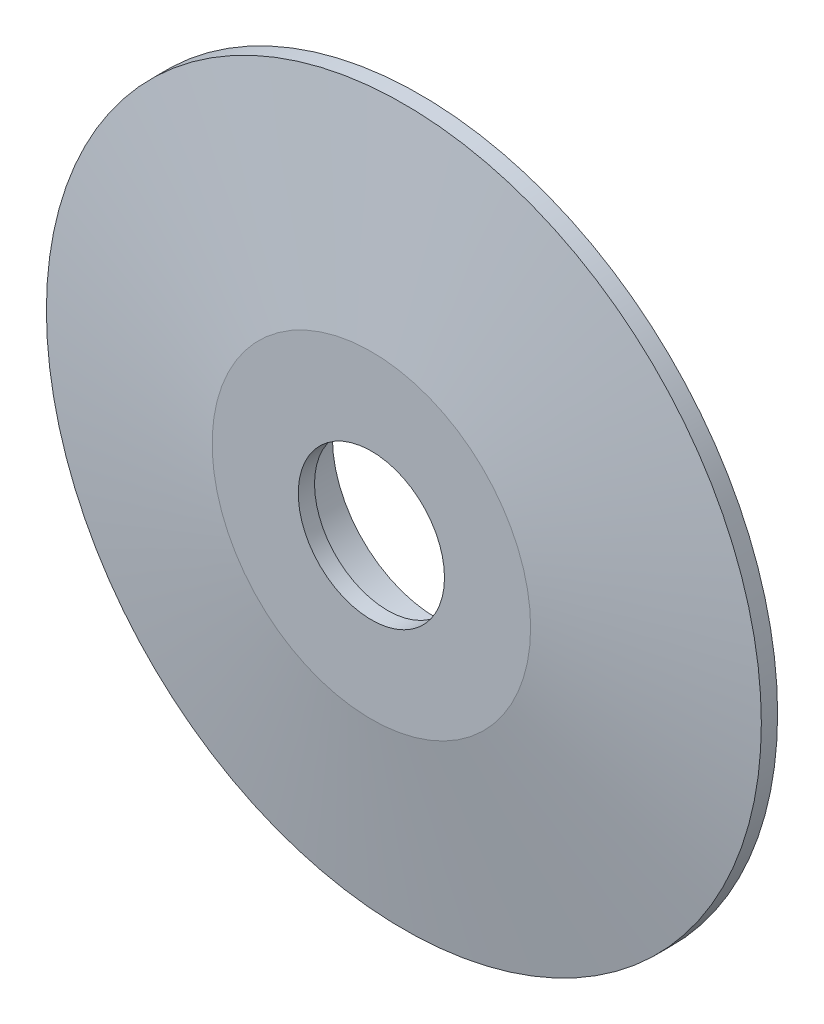
ISO-10303-21;
HEADER;
FILE_DESCRIPTION(('STEP AP214'),'2;1');
FILE_NAME('part.step','',(''),(''),'','','');
FILE_SCHEMA(('AUTOMOTIVE_DESIGN { 1 0 10303 214 1 1 1 1 }'));
ENDSEC;
DATA;
#1=APPLICATION_CONTEXT('core data for automotive mechanical design processes');
#2=APPLICATION_PROTOCOL_DEFINITION('international standard','automotive_design',2000,#1);
#3=PRODUCT_CONTEXT('',#1,'mechanical');
#4=PRODUCT('Part','Part','',(#3));
#5=PRODUCT_RELATED_PRODUCT_CATEGORY('part','',(#4));
#6=PRODUCT_DEFINITION_FORMATION('','',#4);
#7=PRODUCT_DEFINITION_CONTEXT('part definition',#1,'design');
#8=PRODUCT_DEFINITION('design','',#6,#7);
#9=PRODUCT_DEFINITION_SHAPE('','',#8);
#10=(LENGTH_UNIT() NAMED_UNIT(*) SI_UNIT(.MILLI.,.METRE.));
#11=(NAMED_UNIT(*) PLANE_ANGLE_UNIT() SI_UNIT($,.RADIAN.));
#12=(NAMED_UNIT(*) SI_UNIT($,.STERADIAN.) SOLID_ANGLE_UNIT());
#13=UNCERTAINTY_MEASURE_WITH_UNIT(LENGTH_MEASURE(1.E-05),#10,'distance_accuracy_value','');
#14=(GEOMETRIC_REPRESENTATION_CONTEXT(3) GLOBAL_UNCERTAINTY_ASSIGNED_CONTEXT((#13)) GLOBAL_UNIT_ASSIGNED_CONTEXT((#10,
#11,#12)) REPRESENTATION_CONTEXT('',''));
#15=CARTESIAN_POINT('',(0.,0.,0.));
#16=DIRECTION('',(0.,0.,1.));
#17=DIRECTION('',(1.,0.,0.));
#18=AXIS2_PLACEMENT_3D('',#15,#16,#17);
#19=CARTESIAN_POINT('',(0.,0.,10.));
#20=DIRECTION('',(0.,0.,-1.));
#21=DIRECTION('',(-1.,0.,0.));
#22=AXIS2_PLACEMENT_3D('',#19,#20,#21);
#23=PLANE('',#22);
#24=CARTESIAN_POINT('',(0.,0.,10.));
#25=DIRECTION('',(0.,0.,-1.));
#26=DIRECTION('',(-1.,0.,0.));
#27=AXIS2_PLACEMENT_3D('',#24,#25,#26);
#28=CIRCLE('',#27,22.5);
#29=CARTESIAN_POINT('',(-22.5,0.,10.));
#30=VERTEX_POINT('',#29);
#31=EDGE_CURVE('E65',#30,#30,#28,.T.);
#32=ORIENTED_EDGE('',*,*,#31,.F.);
#33=EDGE_LOOP('',(#32));
#34=FACE_BOUND('',#33,.T.);
#35=CARTESIAN_POINT('',(0.,0.,10.));
#36=DIRECTION('',(0.,0.,-1.));
#37=DIRECTION('',(-1.,0.,0.));
#38=AXIS2_PLACEMENT_3D('',#35,#36,#37);
#39=CIRCLE('',#38,32.);
#40=CARTESIAN_POINT('',(-32.,0.,10.));
#41=VERTEX_POINT('',#40);
#42=EDGE_CURVE('E10',#41,#41,#39,.F.);
#43=ORIENTED_EDGE('',*,*,#42,.F.);
#44=EDGE_LOOP('',(#43));
#45=FACE_BOUND('',#44,.T.);
#46=ADVANCED_FACE('F39',(#34,#45),#23,.T.);
#47=CARTESIAN_POINT('',(0.,0.,10.));
#48=DIRECTION('',(0.,0.,-1.));
#49=DIRECTION('',(-1.,0.,0.));
#50=AXIS2_PLACEMENT_3D('',#47,#48,#49);
#51=CIRCLE('',#50,37.);
#52=CARTESIAN_POINT('',(-37.,0.,10.));
#53=VERTEX_POINT('',#52);
#54=EDGE_CURVE('E72',#53,#53,#51,.T.);
#55=ORIENTED_EDGE('',*,*,#54,.F.);
#56=EDGE_LOOP('',(#55));
#57=FACE_BOUND('',#56,.T.);
#58=CARTESIAN_POINT('',(0.,0.,10.));
#59=DIRECTION('',(0.,0.,1.));
#60=DIRECTION('',(1.,0.,0.));
#61=AXIS2_PLACEMENT_3D('',#58,#59,#60);
#62=CIRCLE('',#61,48.5928810789488);
#63=CARTESIAN_POINT('',(48.5928810789488,0.,10.));
#64=VERTEX_POINT('',#63);
#65=EDGE_CURVE('E46',#64,#64,#62,.T.);
#66=ORIENTED_EDGE('',*,*,#65,.F.);
#67=EDGE_LOOP('',(#66));
#68=FACE_BOUND('',#67,.T.);
#69=ADVANCED_FACE('F99',(#57,#68),#23,.T.);
#70=CARTESIAN_POINT('',(0.,0.,1.58224128243845E-11));
#71=DIRECTION('',(0.,0.,-1.));
#72=DIRECTION('',(-1.,0.,0.));
#73=AXIS2_PLACEMENT_3D('',#70,#71,#72);
#74=CONICAL_SURFACE('',#73,109.59288107895,1.40830721757795);
#75=ORIENTED_EDGE('',*,*,#65,.T.);
#76=EDGE_LOOP('',(#75));
#77=FACE_BOUND('',#76,.T.);
#78=CARTESIAN_POINT('',(0.,0.,1.58224128243845E-11));
#79=DIRECTION('',(0.,0.,1.));
#80=DIRECTION('',(1.,0.,0.));
#81=AXIS2_PLACEMENT_3D('',#78,#79,#80);
#82=CIRCLE('',#81,109.59288107895);
#83=CARTESIAN_POINT('',(109.59288107895,0.,1.58224128243845E-11));
#84=VERTEX_POINT('',#83);
#85=EDGE_CURVE('E50',#84,#84,#82,.T.);
#86=ORIENTED_EDGE('',*,*,#85,.F.);
#87=EDGE_LOOP('',(#86));
#88=FACE_BOUND('',#87,.T.);
#89=ADVANCED_FACE('F104',(#77,#88),#74,.F.);
#90=CARTESIAN_POINT('',(0.,0.,1.5851730585559E-11));
#91=DIRECTION('',(0.,0.,1.));
#92=DIRECTION('',(1.,0.,0.));
#93=AXIS2_PLACEMENT_3D('',#90,#91,#92);
#94=PLANE('',#93);
#95=CARTESIAN_POINT('',(0.,0.,1.58813934225677E-11));
#96=DIRECTION('',(0.,0.,1.));
#97=DIRECTION('',(1.,0.,0.));
#98=AXIS2_PLACEMENT_3D('',#95,#96,#97);
#99=CIRCLE('',#98,110.);
#100=CARTESIAN_POINT('',(110.,0.,1.58813934225677E-11));
#101=VERTEX_POINT('',#100);
#102=EDGE_CURVE('E54',#101,#101,#99,.T.);
#103=ORIENTED_EDGE('',*,*,#102,.F.);
#104=EDGE_LOOP('',(#103));
#105=FACE_BOUND('',#104,.T.);
#106=ORIENTED_EDGE('',*,*,#85,.T.);
#107=EDGE_LOOP('',(#106));
#108=FACE_BOUND('',#107,.T.);
#109=ADVANCED_FACE('F111',(#105,#108),#94,.F.);
#110=CARTESIAN_POINT('',(0.,0.,15.));
#111=DIRECTION('',(0.,0.,1.));
#112=DIRECTION('',(1.,0.,0.));
#113=AXIS2_PLACEMENT_3D('',#110,#111,#112);
#114=CYLINDRICAL_SURFACE('',#113,110.);
#115=CARTESIAN_POINT('',(0.,0.,5.));
#116=DIRECTION('',(0.,0.,1.));
#117=DIRECTION('',(1.,0.,0.));
#118=AXIS2_PLACEMENT_3D('',#115,#116,#117);
#119=CIRCLE('',#118,110.);
#120=CARTESIAN_POINT('',(110.,0.,5.));
#121=VERTEX_POINT('',#120);
#122=EDGE_CURVE('E59',#121,#121,#119,.T.);
#123=ORIENTED_EDGE('',*,*,#122,.F.);
#124=EDGE_LOOP('',(#123));
#125=FACE_BOUND('',#124,.T.);
#126=ORIENTED_EDGE('',*,*,#102,.T.);
#127=EDGE_LOOP('',(#126));
#128=FACE_BOUND('',#127,.T.);
#129=ADVANCED_FACE('F114',(#125,#128),#114,.T.);
#130=CARTESIAN_POINT('',(0.,0.,5.));
#131=DIRECTION('',(0.,0.,-1.));
#132=DIRECTION('',(-1.,0.,0.));
#133=AXIS2_PLACEMENT_3D('',#130,#131,#132);
#134=CONICAL_SURFACE('',#133,110.,1.40830721757769);
#135=CARTESIAN_POINT('',(0.,0.,15.));
#136=DIRECTION('',(0.,0.,1.));
#137=DIRECTION('',(1.,0.,0.));
#138=AXIS2_PLACEMENT_3D('',#135,#136,#137);
#139=CIRCLE('',#138,49.);
#140=CARTESIAN_POINT('',(49.,0.,15.));
#141=VERTEX_POINT('',#140);
#142=EDGE_CURVE('E62',#141,#141,#139,.T.);
#143=ORIENTED_EDGE('',*,*,#142,.F.);
#144=EDGE_LOOP('',(#143));
#145=FACE_BOUND('',#144,.T.);
#146=ORIENTED_EDGE('',*,*,#122,.T.);
#147=EDGE_LOOP('',(#146));
#148=FACE_BOUND('',#147,.T.);
#149=ADVANCED_FACE('F118',(#145,#148),#134,.T.);
#150=CARTESIAN_POINT('',(0.,0.,15.));
#151=DIRECTION('',(0.,0.,1.));
#152=DIRECTION('',(1.,0.,0.));
#153=AXIS2_PLACEMENT_3D('',#150,#151,#152);
#154=PLANE('',#153);
#155=CARTESIAN_POINT('',(0.,0.,15.));
#156=DIRECTION('',(0.,0.,1.));
#157=DIRECTION('',(1.,0.,0.));
#158=AXIS2_PLACEMENT_3D('',#155,#156,#157);
#159=CIRCLE('',#158,22.5);
#160=CARTESIAN_POINT('',(22.5,0.,15.));
#161=VERTEX_POINT('',#160);
#162=EDGE_CURVE('E68',#161,#161,#159,.T.);
#163=ORIENTED_EDGE('',*,*,#162,.F.);
#164=EDGE_LOOP('',(#163));
#165=FACE_BOUND('',#164,.T.);
#166=ORIENTED_EDGE('',*,*,#142,.T.);
#167=EDGE_LOOP('',(#166));
#168=FACE_BOUND('',#167,.T.);
#169=ADVANCED_FACE('F41',(#165,#168),#154,.T.);
#170=CARTESIAN_POINT('',(0.,0.,-28.));
#171=DIRECTION('',(0.,0.,1.));
#172=DIRECTION('',(1.,0.,0.));
#173=AXIS2_PLACEMENT_3D('',#170,#171,#172);
#174=CYLINDRICAL_SURFACE('',#173,22.5);
#175=ORIENTED_EDGE('',*,*,#31,.T.);
#176=EDGE_LOOP('',(#175));
#177=FACE_BOUND('',#176,.T.);
#178=ORIENTED_EDGE('',*,*,#162,.T.);
#179=EDGE_LOOP('',(#178));
#180=FACE_BOUND('',#179,.T.);
#181=ADVANCED_FACE('F86',(#177,#180),#174,.F.);
#182=CARTESIAN_POINT('',(0.,0.,-5.));
#183=DIRECTION('',(0.,0.,-1.));
#184=DIRECTION('',(-1.,0.,0.));
#185=AXIS2_PLACEMENT_3D('',#182,#183,#184);
#186=PLANE('',#185);
#187=CARTESIAN_POINT('',(0.,0.,-5.));
#188=DIRECTION('',(0.,0.,-1.));
#189=DIRECTION('',(-1.,0.,0.));
#190=AXIS2_PLACEMENT_3D('',#187,#188,#189);
#191=CIRCLE('',#190,37.);
#192=CARTESIAN_POINT('',(-37.,0.,-5.));
#193=VERTEX_POINT('',#192);
#194=EDGE_CURVE('E71',#193,#193,#191,.T.);
#195=ORIENTED_EDGE('',*,*,#194,.T.);
#196=EDGE_LOOP('',(#195));
#197=FACE_BOUND('',#196,.T.);
#198=CARTESIAN_POINT('',(0.,0.,-5.));
#199=DIRECTION('',(0.,0.,-1.));
#200=DIRECTION('',(-1.,0.,0.));
#201=AXIS2_PLACEMENT_3D('',#198,#199,#200);
#202=CIRCLE('',#201,32.);
#203=CARTESIAN_POINT('',(-32.,0.,-5.));
#204=VERTEX_POINT('',#203);
#205=EDGE_CURVE('E75',#204,#204,#202,.T.);
#206=ORIENTED_EDGE('',*,*,#205,.F.);
#207=EDGE_LOOP('',(#206));
#208=FACE_BOUND('',#207,.T.);
#209=ADVANCED_FACE('F83',(#197,#208),#186,.T.);
#210=CARTESIAN_POINT('',(0.,0.,-5.));
#211=DIRECTION('',(0.,0.,1.));
#212=DIRECTION('',(1.,0.,0.));
#213=AXIS2_PLACEMENT_3D('',#210,#211,#212);
#214=CYLINDRICAL_SURFACE('',#213,37.);
#215=ORIENTED_EDGE('',*,*,#194,.F.);
#216=EDGE_LOOP('',(#215));
#217=FACE_BOUND('',#216,.T.);
#218=ORIENTED_EDGE('',*,*,#54,.T.);
#219=EDGE_LOOP('',(#218));
#220=FACE_BOUND('',#219,.T.);
#221=ADVANCED_FACE('F85',(#217,#220),#214,.T.);
#222=CARTESIAN_POINT('',(0.,0.,-5.));
#223=DIRECTION('',(0.,0.,1.));
#224=DIRECTION('',(1.,0.,0.));
#225=AXIS2_PLACEMENT_3D('',#222,#223,#224);
#226=CYLINDRICAL_SURFACE('',#225,32.);
#227=ORIENTED_EDGE('',*,*,#205,.T.);
#228=EDGE_LOOP('',(#227));
#229=FACE_BOUND('',#228,.T.);
#230=ORIENTED_EDGE('',*,*,#42,.T.);
#231=EDGE_LOOP('',(#230));
#232=FACE_BOUND('',#231,.T.);
#233=ADVANCED_FACE('F81',(#229,#232),#226,.F.);
#234=CLOSED_SHELL('',(#46,#69,#89,#109,#129,#149,#169,#181,#209,#221,#233));
#235=MANIFOLD_SOLID_BREP('B2',#234);
#236=ADVANCED_BREP_SHAPE_REPRESENTATION('',(#18,#235),#14);
#237=SHAPE_DEFINITION_REPRESENTATION(#9,#236);
ENDSEC;
END-ISO-10303-21;
